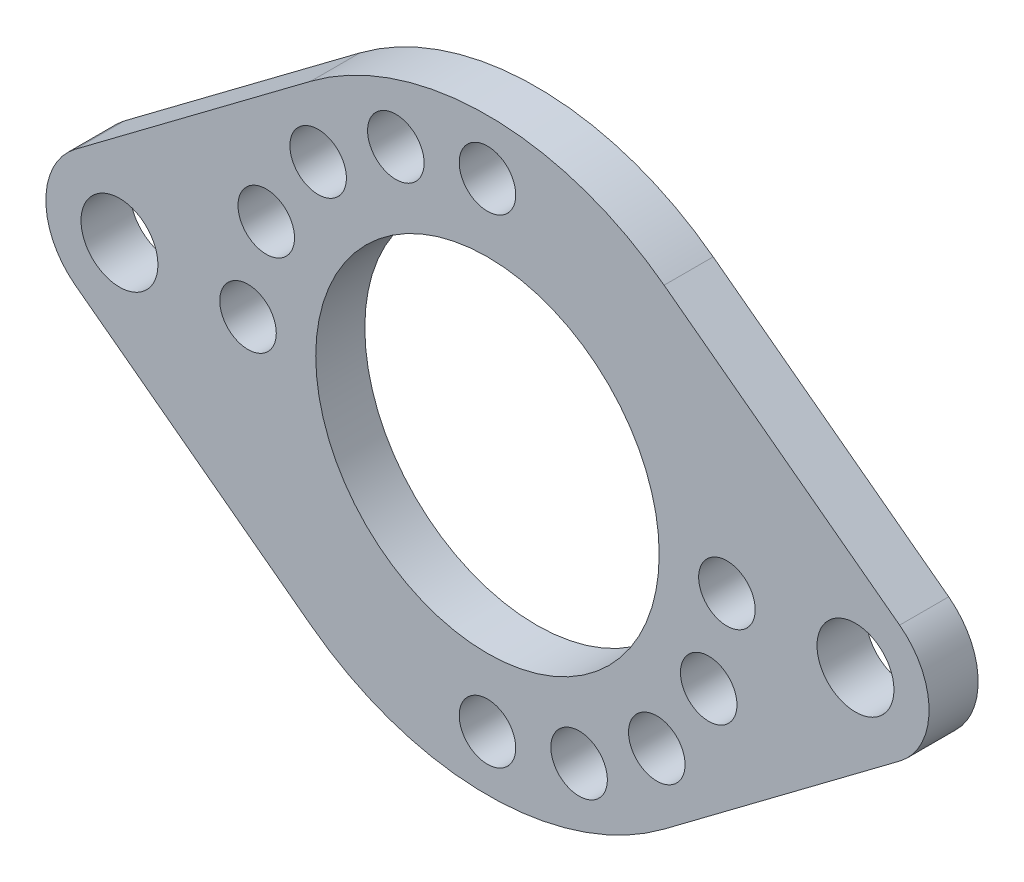
ISO-10303-21;
HEADER;
FILE_DESCRIPTION(('STEP AP214'),'2;1');
FILE_NAME('part.step','',(''),(''),'','','');
FILE_SCHEMA(('AUTOMOTIVE_DESIGN { 1 0 10303 214 1 1 1 1 }'));
ENDSEC;
DATA;
#1=APPLICATION_CONTEXT('core data for automotive mechanical design processes');
#2=APPLICATION_PROTOCOL_DEFINITION('international standard','automotive_design',2000,#1);
#3=PRODUCT_CONTEXT('',#1,'mechanical');
#4=PRODUCT('Part','Part','',(#3));
#5=PRODUCT_RELATED_PRODUCT_CATEGORY('part','',(#4));
#6=PRODUCT_DEFINITION_FORMATION('','',#4);
#7=PRODUCT_DEFINITION_CONTEXT('part definition',#1,'design');
#8=PRODUCT_DEFINITION('design','',#6,#7);
#9=PRODUCT_DEFINITION_SHAPE('','',#8);
#10=(LENGTH_UNIT() NAMED_UNIT(*) SI_UNIT(.MILLI.,.METRE.));
#11=(NAMED_UNIT(*) PLANE_ANGLE_UNIT() SI_UNIT($,.RADIAN.));
#12=(NAMED_UNIT(*) SI_UNIT($,.STERADIAN.) SOLID_ANGLE_UNIT());
#13=UNCERTAINTY_MEASURE_WITH_UNIT(LENGTH_MEASURE(1.E-05),#10,'distance_accuracy_value','');
#14=(GEOMETRIC_REPRESENTATION_CONTEXT(3) GLOBAL_UNCERTAINTY_ASSIGNED_CONTEXT((#13)) GLOBAL_UNIT_ASSIGNED_CONTEXT((#10,
#11,#12)) REPRESENTATION_CONTEXT('',''));
#15=CARTESIAN_POINT('',(0.,0.,0.));
#16=DIRECTION('',(0.,0.,1.));
#17=DIRECTION('',(1.,0.,0.));
#18=AXIS2_PLACEMENT_3D('',#15,#16,#17);
#19=CARTESIAN_POINT('',(0.,0.,-1.5875));
#20=DIRECTION('',(0.,0.,1.));
#21=DIRECTION('',(1.,0.,0.));
#22=AXIS2_PLACEMENT_3D('',#19,#20,#21);
#23=PLANE('',#22);
#24=CARTESIAN_POINT('',(0.,0.,-1.5875));
#25=DIRECTION('',(0.,0.,-1.));
#26=DIRECTION('',(-1.,0.,0.));
#27=AXIS2_PLACEMENT_3D('',#24,#25,#26);
#28=CIRCLE('',#27,11.1125);
#29=CARTESIAN_POINT('',(-11.1125,0.,-1.5875));
#30=VERTEX_POINT('',#29);
#31=EDGE_CURVE('E167',#30,#30,#28,.F.);
#32=ORIENTED_EDGE('',*,*,#31,.T.);
#33=EDGE_LOOP('',(#32));
#34=FACE_BOUND('',#33,.T.);
#35=CARTESIAN_POINT('',(-23.8125,0.,-1.5875));
#36=DIRECTION('',(0.,0.,-1.));
#37=DIRECTION('',(-1.,0.,0.));
#38=AXIS2_PLACEMENT_3D('',#35,#36,#37);
#39=CIRCLE('',#38,4.7625);
#40=CARTESIAN_POINT('',(-26.67,3.81,-1.5875));
#41=VERTEX_POINT('',#40);
#42=CARTESIAN_POINT('',(-26.67,-3.81,-1.5875));
#43=VERTEX_POINT('',#42);
#44=EDGE_CURVE('E171',#41,#43,#39,.F.);
#45=ORIENTED_EDGE('',*,*,#44,.F.);
#46=DIRECTION('',(-0.8,-0.6,0.));
#47=VECTOR('',#46,1.);
#48=CARTESIAN_POINT('',(-11.43,15.24,-1.5875));
#49=LINE('',#48,#47);
#50=CARTESIAN_POINT('',(-11.43,15.24,-1.5875));
#51=VERTEX_POINT('',#50);
#52=EDGE_CURVE('E110',#51,#41,#49,.T.);
#53=ORIENTED_EDGE('',*,*,#52,.F.);
#54=CARTESIAN_POINT('',(0.,0.,-1.5875));
#55=DIRECTION('',(0.,0.,-1.));
#56=DIRECTION('',(-1.,0.,0.));
#57=AXIS2_PLACEMENT_3D('',#54,#55,#56);
#58=CIRCLE('',#57,19.05);
#59=CARTESIAN_POINT('',(11.43,15.24,-1.5875));
#60=VERTEX_POINT('',#59);
#61=EDGE_CURVE('E115',#60,#51,#58,.F.);
#62=ORIENTED_EDGE('',*,*,#61,.F.);
#63=DIRECTION('',(0.8,-0.6,0.));
#64=VECTOR('',#63,1.);
#65=CARTESIAN_POINT('',(11.43,15.24,-1.5875));
#66=LINE('',#65,#64);
#67=CARTESIAN_POINT('',(26.67,3.81,-1.5875));
#68=VERTEX_POINT('',#67);
#69=EDGE_CURVE('E114',#60,#68,#66,.T.);
#70=ORIENTED_EDGE('',*,*,#69,.T.);
#71=CARTESIAN_POINT('',(23.8125,0.,-1.5875));
#72=DIRECTION('',(0.,0.,-1.));
#73=DIRECTION('',(-1.,0.,0.));
#74=AXIS2_PLACEMENT_3D('',#71,#72,#73);
#75=CIRCLE('',#74,4.7625);
#76=CARTESIAN_POINT('',(26.67,-3.81,-1.5875));
#77=VERTEX_POINT('',#76);
#78=EDGE_CURVE('E94',#77,#68,#75,.F.);
#79=ORIENTED_EDGE('',*,*,#78,.F.);
#80=DIRECTION('',(-0.8,-0.6,0.));
#81=VECTOR('',#80,1.);
#82=CARTESIAN_POINT('',(11.43,-15.24,-1.5875));
#83=LINE('',#82,#81);
#84=CARTESIAN_POINT('',(11.43,-15.24,-1.5875));
#85=VERTEX_POINT('',#84);
#86=EDGE_CURVE('E91',#77,#85,#83,.T.);
#87=ORIENTED_EDGE('',*,*,#86,.T.);
#88=CARTESIAN_POINT('',(0.,0.,-1.5875));
#89=DIRECTION('',(0.,0.,-1.));
#90=DIRECTION('',(-1.,0.,0.));
#91=AXIS2_PLACEMENT_3D('',#88,#89,#90);
#92=CIRCLE('',#91,19.05);
#93=CARTESIAN_POINT('',(-11.43,-15.24,-1.5875));
#94=VERTEX_POINT('',#93);
#95=EDGE_CURVE('E78',#94,#85,#92,.F.);
#96=ORIENTED_EDGE('',*,*,#95,.F.);
#97=DIRECTION('',(-0.8,0.6,0.));
#98=VECTOR('',#97,1.);
#99=CARTESIAN_POINT('',(-11.43,-15.24,-1.5875));
#100=LINE('',#99,#98);
#101=EDGE_CURVE('E88',#94,#43,#100,.T.);
#102=ORIENTED_EDGE('',*,*,#101,.T.);
#103=EDGE_LOOP('',(#45,#53,#62,#70,#79,#87,#96,#102));
#104=FACE_BOUND('',#103,.T.);
#105=CARTESIAN_POINT('',(0.,15.494,-1.5875));
#106=DIRECTION('',(0.,0.,1.));
#107=DIRECTION('',(1.,0.,0.));
#108=AXIS2_PLACEMENT_3D('',#105,#106,#107);
#109=CIRCLE('',#108,1.82879999999999);
#110=CARTESIAN_POINT('',(1.82879999999999,15.494,-1.5875));
#111=VERTEX_POINT('',#110);
#112=EDGE_CURVE('E109',#111,#111,#109,.T.);
#113=ORIENTED_EDGE('',*,*,#112,.T.);
#114=EDGE_LOOP('',(#113));
#115=FACE_BOUND('',#114,.T.);
#116=CARTESIAN_POINT('',(-15.494,0.,-1.5875));
#117=DIRECTION('',(0.,0.,1.));
#118=DIRECTION('',(1.,0.,0.));
#119=AXIS2_PLACEMENT_3D('',#116,#117,#118);
#120=CIRCLE('',#119,1.82879999999999);
#121=CARTESIAN_POINT('',(-13.6652,0.,-1.5875));
#122=VERTEX_POINT('',#121);
#123=EDGE_CURVE('E179',#122,#122,#120,.T.);
#124=ORIENTED_EDGE('',*,*,#123,.T.);
#125=EDGE_LOOP('',(#124));
#126=FACE_BOUND('',#125,.T.);
#127=CARTESIAN_POINT('',(-14.3145894767299,5.92929710106476,-1.5875));
#128=DIRECTION('',(0.,0.,1.));
#129=DIRECTION('',(1.,0.,0.));
#130=AXIS2_PLACEMENT_3D('',#127,#128,#129);
#131=CIRCLE('',#130,1.82879999999999);
#132=CARTESIAN_POINT('',(-12.4857894767299,5.92929710106476,-1.5875));
#133=VERTEX_POINT('',#132);
#134=EDGE_CURVE('E182',#133,#133,#131,.T.);
#135=ORIENTED_EDGE('',*,*,#134,.T.);
#136=EDGE_LOOP('',(#135));
#137=FACE_BOUND('',#136,.T.);
#138=CARTESIAN_POINT('',(-5.92929710106471,14.3145894767299,-1.5875));
#139=DIRECTION('',(0.,0.,1.));
#140=DIRECTION('',(1.,0.,0.));
#141=AXIS2_PLACEMENT_3D('',#138,#139,#140);
#142=CIRCLE('',#141,1.82879999999999);
#143=CARTESIAN_POINT('',(-4.10049710106472,14.3145894767299,-1.5875));
#144=VERTEX_POINT('',#143);
#145=EDGE_CURVE('E185',#144,#144,#142,.T.);
#146=ORIENTED_EDGE('',*,*,#145,.T.);
#147=EDGE_LOOP('',(#146));
#148=FACE_BOUND('',#147,.T.);
#149=CARTESIAN_POINT('',(-10.9559124677044,10.9559124677043,-1.5875));
#150=DIRECTION('',(0.,0.,1.));
#151=DIRECTION('',(1.,0.,0.));
#152=AXIS2_PLACEMENT_3D('',#149,#150,#151);
#153=CIRCLE('',#152,1.82879999999999);
#154=CARTESIAN_POINT('',(-9.1271124677044,10.9559124677043,-1.5875));
#155=VERTEX_POINT('',#154);
#156=EDGE_CURVE('E188',#155,#155,#153,.T.);
#157=ORIENTED_EDGE('',*,*,#156,.T.);
#158=EDGE_LOOP('',(#157));
#159=FACE_BOUND('',#158,.T.);
#160=CARTESIAN_POINT('',(0.,-15.494,-1.5875));
#161=DIRECTION('',(0.,0.,1.));
#162=DIRECTION('',(1.,0.,0.));
#163=AXIS2_PLACEMENT_3D('',#160,#161,#162);
#164=CIRCLE('',#163,1.82879999999999);
#165=CARTESIAN_POINT('',(1.82879999999999,-15.494,-1.5875));
#166=VERTEX_POINT('',#165);
#167=EDGE_CURVE('E191',#166,#166,#164,.T.);
#168=ORIENTED_EDGE('',*,*,#167,.T.);
#169=EDGE_LOOP('',(#168));
#170=FACE_BOUND('',#169,.T.);
#171=CARTESIAN_POINT('',(15.494,0.,-1.5875));
#172=DIRECTION('',(0.,0.,1.));
#173=DIRECTION('',(1.,0.,0.));
#174=AXIS2_PLACEMENT_3D('',#171,#172,#173);
#175=CIRCLE('',#174,1.82879999999999);
#176=CARTESIAN_POINT('',(17.3228,0.,-1.5875));
#177=VERTEX_POINT('',#176);
#178=EDGE_CURVE('E194',#177,#177,#175,.T.);
#179=ORIENTED_EDGE('',*,*,#178,.T.);
#180=EDGE_LOOP('',(#179));
#181=FACE_BOUND('',#180,.T.);
#182=CARTESIAN_POINT('',(14.3145894767299,-5.92929710106476,-1.5875));
#183=DIRECTION('',(0.,0.,1.));
#184=DIRECTION('',(1.,0.,0.));
#185=AXIS2_PLACEMENT_3D('',#182,#183,#184);
#186=CIRCLE('',#185,1.82879999999999);
#187=CARTESIAN_POINT('',(16.1433894767298,-5.92929710106476,-1.5875));
#188=VERTEX_POINT('',#187);
#189=EDGE_CURVE('E197',#188,#188,#186,.T.);
#190=ORIENTED_EDGE('',*,*,#189,.T.);
#191=EDGE_LOOP('',(#190));
#192=FACE_BOUND('',#191,.T.);
#193=CARTESIAN_POINT('',(5.92929710106471,-14.3145894767299,-1.5875));
#194=DIRECTION('',(0.,0.,1.));
#195=DIRECTION('',(1.,0.,0.));
#196=AXIS2_PLACEMENT_3D('',#193,#194,#195);
#197=CIRCLE('',#196,1.82879999999999);
#198=CARTESIAN_POINT('',(7.7580971010647,-14.3145894767299,-1.5875));
#199=VERTEX_POINT('',#198);
#200=EDGE_CURVE('E200',#199,#199,#197,.T.);
#201=ORIENTED_EDGE('',*,*,#200,.T.);
#202=EDGE_LOOP('',(#201));
#203=FACE_BOUND('',#202,.T.);
#204=CARTESIAN_POINT('',(10.9559124677044,-10.9559124677043,-1.5875));
#205=DIRECTION('',(0.,0.,1.));
#206=DIRECTION('',(1.,0.,0.));
#207=AXIS2_PLACEMENT_3D('',#204,#205,#206);
#208=CIRCLE('',#207,1.82879999999999);
#209=CARTESIAN_POINT('',(12.7847124677044,-10.9559124677043,-1.5875));
#210=VERTEX_POINT('',#209);
#211=EDGE_CURVE('E203',#210,#210,#208,.T.);
#212=ORIENTED_EDGE('',*,*,#211,.T.);
#213=EDGE_LOOP('',(#212));
#214=FACE_BOUND('',#213,.T.);
#215=CARTESIAN_POINT('',(-23.8125,0.,-1.5875));
#216=DIRECTION('',(0.,0.,1.));
#217=DIRECTION('',(1.,0.,0.));
#218=AXIS2_PLACEMENT_3D('',#215,#216,#217);
#219=CIRCLE('',#218,2.48919999999999);
#220=CARTESIAN_POINT('',(-21.3233,0.,-1.5875));
#221=VERTEX_POINT('',#220);
#222=EDGE_CURVE('E205',#221,#221,#219,.T.);
#223=ORIENTED_EDGE('',*,*,#222,.T.);
#224=EDGE_LOOP('',(#223));
#225=FACE_BOUND('',#224,.T.);
#226=CARTESIAN_POINT('',(23.8125,0.,-1.5875));
#227=DIRECTION('',(0.,0.,1.));
#228=DIRECTION('',(1.,0.,0.));
#229=AXIS2_PLACEMENT_3D('',#226,#227,#228);
#230=CIRCLE('',#229,2.48919999999999);
#231=CARTESIAN_POINT('',(26.3017,0.,-1.5875));
#232=VERTEX_POINT('',#231);
#233=EDGE_CURVE('E19',#232,#232,#230,.T.);
#234=ORIENTED_EDGE('',*,*,#233,.T.);
#235=EDGE_LOOP('',(#234));
#236=FACE_BOUND('',#235,.T.);
#237=ADVANCED_FACE('F16',(#34,#104,#115,#126,#137,#148,#159,#170,#181,#192,#203,#214,#225,#236),
#23,.F.);
#238=CARTESIAN_POINT('',(23.8125,0.,1.5875));
#239=DIRECTION('',(0.,0.,1.));
#240=DIRECTION('',(1.,0.,0.));
#241=AXIS2_PLACEMENT_3D('',#238,#239,#240);
#242=CYLINDRICAL_SURFACE('',#241,2.48919999999999);
#243=CARTESIAN_POINT('',(23.8125,0.,1.5875));
#244=DIRECTION('',(0.,0.,1.));
#245=DIRECTION('',(1.,0.,0.));
#246=AXIS2_PLACEMENT_3D('',#243,#244,#245);
#247=CIRCLE('',#246,2.48919999999999);
#248=CARTESIAN_POINT('',(26.3017,0.,1.5875));
#249=VERTEX_POINT('',#248);
#250=EDGE_CURVE('E164',#249,#249,#247,.F.);
#251=ORIENTED_EDGE('',*,*,#250,.F.);
#252=EDGE_LOOP('',(#251));
#253=FACE_BOUND('',#252,.T.);
#254=ORIENTED_EDGE('',*,*,#233,.F.);
#255=EDGE_LOOP('',(#254));
#256=FACE_BOUND('',#255,.T.);
#257=ADVANCED_FACE('F213',(#253,#256),#242,.F.);
#258=CARTESIAN_POINT('',(-23.8125,0.,1.5875));
#259=DIRECTION('',(0.,0.,1.));
#260=DIRECTION('',(1.,0.,0.));
#261=AXIS2_PLACEMENT_3D('',#258,#259,#260);
#262=CYLINDRICAL_SURFACE('',#261,2.48919999999999);
#263=CARTESIAN_POINT('',(-23.8125,0.,1.5875));
#264=DIRECTION('',(0.,0.,1.));
#265=DIRECTION('',(1.,0.,0.));
#266=AXIS2_PLACEMENT_3D('',#263,#264,#265);
#267=CIRCLE('',#266,2.48919999999999);
#268=CARTESIAN_POINT('',(-21.3233,0.,1.5875));
#269=VERTEX_POINT('',#268);
#270=EDGE_CURVE('E161',#269,#269,#267,.F.);
#271=ORIENTED_EDGE('',*,*,#270,.F.);
#272=EDGE_LOOP('',(#271));
#273=FACE_BOUND('',#272,.T.);
#274=ORIENTED_EDGE('',*,*,#222,.F.);
#275=EDGE_LOOP('',(#274));
#276=FACE_BOUND('',#275,.T.);
#277=ADVANCED_FACE('F215',(#273,#276),#262,.F.);
#278=CARTESIAN_POINT('',(10.9559124677044,-10.9559124677043,1.5875));
#279=DIRECTION('',(0.,0.,1.));
#280=DIRECTION('',(1.,0.,0.));
#281=AXIS2_PLACEMENT_3D('',#278,#279,#280);
#282=CYLINDRICAL_SURFACE('',#281,1.82879999999999);
#283=CARTESIAN_POINT('',(10.9559124677044,-10.9559124677043,1.5875));
#284=DIRECTION('',(0.,0.,1.));
#285=DIRECTION('',(1.,0.,0.));
#286=AXIS2_PLACEMENT_3D('',#283,#284,#285);
#287=CIRCLE('',#286,1.82879999999999);
#288=CARTESIAN_POINT('',(12.7847124677044,-10.9559124677043,1.5875));
#289=VERTEX_POINT('',#288);
#290=EDGE_CURVE('E158',#289,#289,#287,.F.);
#291=ORIENTED_EDGE('',*,*,#290,.F.);
#292=EDGE_LOOP('',(#291));
#293=FACE_BOUND('',#292,.T.);
#294=ORIENTED_EDGE('',*,*,#211,.F.);
#295=EDGE_LOOP('',(#294));
#296=FACE_BOUND('',#295,.T.);
#297=ADVANCED_FACE('F222',(#293,#296),#282,.F.);
#298=CARTESIAN_POINT('',(5.92929710106471,-14.3145894767299,1.5875));
#299=DIRECTION('',(0.,0.,1.));
#300=DIRECTION('',(1.,0.,0.));
#301=AXIS2_PLACEMENT_3D('',#298,#299,#300);
#302=CYLINDRICAL_SURFACE('',#301,1.82879999999999);
#303=CARTESIAN_POINT('',(5.92929710106471,-14.3145894767299,1.5875));
#304=DIRECTION('',(0.,0.,1.));
#305=DIRECTION('',(1.,0.,0.));
#306=AXIS2_PLACEMENT_3D('',#303,#304,#305);
#307=CIRCLE('',#306,1.82879999999999);
#308=CARTESIAN_POINT('',(7.7580971010647,-14.3145894767299,1.5875));
#309=VERTEX_POINT('',#308);
#310=EDGE_CURVE('E155',#309,#309,#307,.F.);
#311=ORIENTED_EDGE('',*,*,#310,.F.);
#312=EDGE_LOOP('',(#311));
#313=FACE_BOUND('',#312,.T.);
#314=ORIENTED_EDGE('',*,*,#200,.F.);
#315=EDGE_LOOP('',(#314));
#316=FACE_BOUND('',#315,.T.);
#317=ADVANCED_FACE('F297',(#313,#316),#302,.F.);
#318=CARTESIAN_POINT('',(14.3145894767299,-5.92929710106476,1.5875));
#319=DIRECTION('',(0.,0.,1.));
#320=DIRECTION('',(1.,0.,0.));
#321=AXIS2_PLACEMENT_3D('',#318,#319,#320);
#322=CYLINDRICAL_SURFACE('',#321,1.82879999999999);
#323=CARTESIAN_POINT('',(14.3145894767299,-5.92929710106476,1.5875));
#324=DIRECTION('',(0.,0.,1.));
#325=DIRECTION('',(1.,0.,0.));
#326=AXIS2_PLACEMENT_3D('',#323,#324,#325);
#327=CIRCLE('',#326,1.82879999999999);
#328=CARTESIAN_POINT('',(16.1433894767298,-5.92929710106476,1.5875));
#329=VERTEX_POINT('',#328);
#330=EDGE_CURVE('E152',#329,#329,#327,.F.);
#331=ORIENTED_EDGE('',*,*,#330,.F.);
#332=EDGE_LOOP('',(#331));
#333=FACE_BOUND('',#332,.T.);
#334=ORIENTED_EDGE('',*,*,#189,.F.);
#335=EDGE_LOOP('',(#334));
#336=FACE_BOUND('',#335,.T.);
#337=ADVANCED_FACE('F293',(#333,#336),#322,.F.);
#338=CARTESIAN_POINT('',(15.494,0.,1.5875));
#339=DIRECTION('',(0.,0.,1.));
#340=DIRECTION('',(1.,0.,0.));
#341=AXIS2_PLACEMENT_3D('',#338,#339,#340);
#342=CYLINDRICAL_SURFACE('',#341,1.82879999999999);
#343=CARTESIAN_POINT('',(15.494,0.,1.5875));
#344=DIRECTION('',(0.,0.,1.));
#345=DIRECTION('',(1.,0.,0.));
#346=AXIS2_PLACEMENT_3D('',#343,#344,#345);
#347=CIRCLE('',#346,1.82879999999999);
#348=CARTESIAN_POINT('',(17.3228,0.,1.5875));
#349=VERTEX_POINT('',#348);
#350=EDGE_CURVE('E149',#349,#349,#347,.F.);
#351=ORIENTED_EDGE('',*,*,#350,.F.);
#352=EDGE_LOOP('',(#351));
#353=FACE_BOUND('',#352,.T.);
#354=ORIENTED_EDGE('',*,*,#178,.F.);
#355=EDGE_LOOP('',(#354));
#356=FACE_BOUND('',#355,.T.);
#357=ADVANCED_FACE('F289',(#353,#356),#342,.F.);
#358=CARTESIAN_POINT('',(0.,-15.494,1.5875));
#359=DIRECTION('',(0.,0.,1.));
#360=DIRECTION('',(1.,0.,0.));
#361=AXIS2_PLACEMENT_3D('',#358,#359,#360);
#362=CYLINDRICAL_SURFACE('',#361,1.82879999999999);
#363=CARTESIAN_POINT('',(0.,-15.494,1.5875));
#364=DIRECTION('',(0.,0.,1.));
#365=DIRECTION('',(1.,0.,0.));
#366=AXIS2_PLACEMENT_3D('',#363,#364,#365);
#367=CIRCLE('',#366,1.82879999999999);
#368=CARTESIAN_POINT('',(1.82879999999999,-15.494,1.5875));
#369=VERTEX_POINT('',#368);
#370=EDGE_CURVE('E146',#369,#369,#367,.F.);
#371=ORIENTED_EDGE('',*,*,#370,.F.);
#372=EDGE_LOOP('',(#371));
#373=FACE_BOUND('',#372,.T.);
#374=ORIENTED_EDGE('',*,*,#167,.F.);
#375=EDGE_LOOP('',(#374));
#376=FACE_BOUND('',#375,.T.);
#377=ADVANCED_FACE('F285',(#373,#376),#362,.F.);
#378=CARTESIAN_POINT('',(-10.9559124677044,10.9559124677043,1.5875));
#379=DIRECTION('',(0.,0.,1.));
#380=DIRECTION('',(1.,0.,0.));
#381=AXIS2_PLACEMENT_3D('',#378,#379,#380);
#382=CYLINDRICAL_SURFACE('',#381,1.82879999999999);
#383=CARTESIAN_POINT('',(-10.9559124677044,10.9559124677043,1.5875));
#384=DIRECTION('',(0.,0.,1.));
#385=DIRECTION('',(1.,0.,0.));
#386=AXIS2_PLACEMENT_3D('',#383,#384,#385);
#387=CIRCLE('',#386,1.82879999999999);
#388=CARTESIAN_POINT('',(-9.1271124677044,10.9559124677043,1.5875));
#389=VERTEX_POINT('',#388);
#390=EDGE_CURVE('E143',#389,#389,#387,.F.);
#391=ORIENTED_EDGE('',*,*,#390,.F.);
#392=EDGE_LOOP('',(#391));
#393=FACE_BOUND('',#392,.T.);
#394=ORIENTED_EDGE('',*,*,#156,.F.);
#395=EDGE_LOOP('',(#394));
#396=FACE_BOUND('',#395,.T.);
#397=ADVANCED_FACE('F281',(#393,#396),#382,.F.);
#398=CARTESIAN_POINT('',(-5.92929710106471,14.3145894767299,1.5875));
#399=DIRECTION('',(0.,0.,1.));
#400=DIRECTION('',(1.,0.,0.));
#401=AXIS2_PLACEMENT_3D('',#398,#399,#400);
#402=CYLINDRICAL_SURFACE('',#401,1.82879999999999);
#403=CARTESIAN_POINT('',(-5.92929710106471,14.3145894767299,1.5875));
#404=DIRECTION('',(0.,0.,1.));
#405=DIRECTION('',(1.,0.,0.));
#406=AXIS2_PLACEMENT_3D('',#403,#404,#405);
#407=CIRCLE('',#406,1.82879999999999);
#408=CARTESIAN_POINT('',(-4.10049710106472,14.3145894767299,1.5875));
#409=VERTEX_POINT('',#408);
#410=EDGE_CURVE('E140',#409,#409,#407,.F.);
#411=ORIENTED_EDGE('',*,*,#410,.F.);
#412=EDGE_LOOP('',(#411));
#413=FACE_BOUND('',#412,.T.);
#414=ORIENTED_EDGE('',*,*,#145,.F.);
#415=EDGE_LOOP('',(#414));
#416=FACE_BOUND('',#415,.T.);
#417=ADVANCED_FACE('F277',(#413,#416),#402,.F.);
#418=CARTESIAN_POINT('',(-14.3145894767299,5.92929710106476,1.5875));
#419=DIRECTION('',(0.,0.,1.));
#420=DIRECTION('',(1.,0.,0.));
#421=AXIS2_PLACEMENT_3D('',#418,#419,#420);
#422=CYLINDRICAL_SURFACE('',#421,1.82879999999999);
#423=CARTESIAN_POINT('',(-14.3145894767299,5.92929710106476,1.5875));
#424=DIRECTION('',(0.,0.,1.));
#425=DIRECTION('',(1.,0.,0.));
#426=AXIS2_PLACEMENT_3D('',#423,#424,#425);
#427=CIRCLE('',#426,1.82879999999999);
#428=CARTESIAN_POINT('',(-12.4857894767299,5.92929710106476,1.5875));
#429=VERTEX_POINT('',#428);
#430=EDGE_CURVE('E137',#429,#429,#427,.F.);
#431=ORIENTED_EDGE('',*,*,#430,.F.);
#432=EDGE_LOOP('',(#431));
#433=FACE_BOUND('',#432,.T.);
#434=ORIENTED_EDGE('',*,*,#134,.F.);
#435=EDGE_LOOP('',(#434));
#436=FACE_BOUND('',#435,.T.);
#437=ADVANCED_FACE('F273',(#433,#436),#422,.F.);
#438=CARTESIAN_POINT('',(-15.494,0.,1.5875));
#439=DIRECTION('',(0.,0.,1.));
#440=DIRECTION('',(1.,0.,0.));
#441=AXIS2_PLACEMENT_3D('',#438,#439,#440);
#442=CYLINDRICAL_SURFACE('',#441,1.82879999999999);
#443=CARTESIAN_POINT('',(-15.494,0.,1.5875));
#444=DIRECTION('',(0.,0.,1.));
#445=DIRECTION('',(1.,0.,0.));
#446=AXIS2_PLACEMENT_3D('',#443,#444,#445);
#447=CIRCLE('',#446,1.82879999999999);
#448=CARTESIAN_POINT('',(-13.6652,0.,1.5875));
#449=VERTEX_POINT('',#448);
#450=EDGE_CURVE('E134',#449,#449,#447,.F.);
#451=ORIENTED_EDGE('',*,*,#450,.F.);
#452=EDGE_LOOP('',(#451));
#453=FACE_BOUND('',#452,.T.);
#454=ORIENTED_EDGE('',*,*,#123,.F.);
#455=EDGE_LOOP('',(#454));
#456=FACE_BOUND('',#455,.T.);
#457=ADVANCED_FACE('F269',(#453,#456),#442,.F.);
#458=CARTESIAN_POINT('',(0.,15.494,1.5875));
#459=DIRECTION('',(0.,0.,1.));
#460=DIRECTION('',(1.,0.,0.));
#461=AXIS2_PLACEMENT_3D('',#458,#459,#460);
#462=CYLINDRICAL_SURFACE('',#461,1.82879999999999);
#463=CARTESIAN_POINT('',(0.,15.494,1.5875));
#464=DIRECTION('',(0.,0.,1.));
#465=DIRECTION('',(1.,0.,0.));
#466=AXIS2_PLACEMENT_3D('',#463,#464,#465);
#467=CIRCLE('',#466,1.82879999999999);
#468=CARTESIAN_POINT('',(1.82879999999999,15.494,1.5875));
#469=VERTEX_POINT('',#468);
#470=EDGE_CURVE('E131',#469,#469,#467,.F.);
#471=ORIENTED_EDGE('',*,*,#470,.F.);
#472=EDGE_LOOP('',(#471));
#473=FACE_BOUND('',#472,.T.);
#474=ORIENTED_EDGE('',*,*,#112,.F.);
#475=EDGE_LOOP('',(#474));
#476=FACE_BOUND('',#475,.T.);
#477=ADVANCED_FACE('F265',(#473,#476),#462,.F.);
#478=CARTESIAN_POINT('',(-11.43,-15.24,1.5875));
#479=DIRECTION('',(0.6,0.8,0.));
#480=DIRECTION('',(-0.8,0.6,0.));
#481=AXIS2_PLACEMENT_3D('',#478,#479,#480);
#482=PLANE('',#481);
#483=DIRECTION('',(0.,0.,-1.));
#484=VECTOR('',#483,1.);
#485=CARTESIAN_POINT('',(-11.43,-15.24,1.5875));
#486=LINE('',#485,#484);
#487=CARTESIAN_POINT('',(-11.43,-15.24,1.5875));
#488=VERTEX_POINT('',#487);
#489=EDGE_CURVE('E87',#488,#94,#486,.T.);
#490=ORIENTED_EDGE('',*,*,#489,.F.);
#491=DIRECTION('',(0.8,-0.6,0.));
#492=VECTOR('',#491,1.);
#493=CARTESIAN_POINT('',(-26.67,-3.81,1.5875));
#494=LINE('',#493,#492);
#495=CARTESIAN_POINT('',(-26.67,-3.81,1.5875));
#496=VERTEX_POINT('',#495);
#497=EDGE_CURVE('E130',#496,#488,#494,.T.);
#498=ORIENTED_EDGE('',*,*,#497,.F.);
#499=DIRECTION('',(0.,0.,-1.));
#500=VECTOR('',#499,1.);
#501=CARTESIAN_POINT('',(-26.67,-3.81,1.5875));
#502=LINE('',#501,#500);
#503=EDGE_CURVE('E170',#43,#496,#502,.F.);
#504=ORIENTED_EDGE('',*,*,#503,.F.);
#505=ORIENTED_EDGE('',*,*,#101,.F.);
#506=EDGE_LOOP('',(#490,#498,#504,#505));
#507=FACE_BOUND('',#506,.T.);
#508=ADVANCED_FACE('F262',(#507),#482,.F.);
#509=CARTESIAN_POINT('',(0.,0.,1.5875));
#510=DIRECTION('',(0.,0.,-1.));
#511=DIRECTION('',(-1.,0.,0.));
#512=AXIS2_PLACEMENT_3D('',#509,#510,#511);
#513=CYLINDRICAL_SURFACE('',#512,19.05);
#514=CARTESIAN_POINT('',(0.,0.,1.5875));
#515=DIRECTION('',(0.,0.,-1.));
#516=DIRECTION('',(-1.,0.,0.));
#517=AXIS2_PLACEMENT_3D('',#514,#515,#516);
#518=CIRCLE('',#517,19.05);
#519=CARTESIAN_POINT('',(11.43,-15.24,1.5875));
#520=VERTEX_POINT('',#519);
#521=EDGE_CURVE('E128',#488,#520,#518,.F.);
#522=ORIENTED_EDGE('',*,*,#521,.F.);
#523=ORIENTED_EDGE('',*,*,#489,.T.);
#524=ORIENTED_EDGE('',*,*,#95,.T.);
#525=DIRECTION('',(0.,0.,1.));
#526=VECTOR('',#525,1.);
#527=CARTESIAN_POINT('',(11.43,-15.24,1.5875));
#528=LINE('',#527,#526);
#529=EDGE_CURVE('E85',#85,#520,#528,.T.);
#530=ORIENTED_EDGE('',*,*,#529,.T.);
#531=EDGE_LOOP('',(#522,#523,#524,#530));
#532=FACE_BOUND('',#531,.T.);
#533=ADVANCED_FACE('F83',(#532),#513,.T.);
#534=CARTESIAN_POINT('',(11.43,-15.24,1.5875));
#535=DIRECTION('',(-0.6,0.8,0.));
#536=DIRECTION('',(-0.8,-0.6,0.));
#537=AXIS2_PLACEMENT_3D('',#534,#535,#536);
#538=PLANE('',#537);
#539=DIRECTION('',(0.,0.,-1.));
#540=VECTOR('',#539,1.);
#541=CARTESIAN_POINT('',(26.67,-3.81,1.5875));
#542=LINE('',#541,#540);
#543=CARTESIAN_POINT('',(26.67,-3.81,1.5875));
#544=VERTEX_POINT('',#543);
#545=EDGE_CURVE('E105',#544,#77,#542,.T.);
#546=ORIENTED_EDGE('',*,*,#545,.F.);
#547=DIRECTION('',(0.8,0.6,0.));
#548=VECTOR('',#547,1.);
#549=CARTESIAN_POINT('',(11.43,-15.24,1.5875));
#550=LINE('',#549,#548);
#551=EDGE_CURVE('E100',#520,#544,#550,.T.);
#552=ORIENTED_EDGE('',*,*,#551,.F.);
#553=ORIENTED_EDGE('',*,*,#529,.F.);
#554=ORIENTED_EDGE('',*,*,#86,.F.);
#555=EDGE_LOOP('',(#546,#552,#553,#554));
#556=FACE_BOUND('',#555,.T.);
#557=ADVANCED_FACE('F98',(#556),#538,.F.);
#558=CARTESIAN_POINT('',(23.8125,0.,1.5875));
#559=DIRECTION('',(0.,0.,-1.));
#560=DIRECTION('',(-1.,0.,0.));
#561=AXIS2_PLACEMENT_3D('',#558,#559,#560);
#562=CYLINDRICAL_SURFACE('',#561,4.7625);
#563=CARTESIAN_POINT('',(23.8125,0.,1.5875));
#564=DIRECTION('',(0.,0.,-1.));
#565=DIRECTION('',(-1.,0.,0.));
#566=AXIS2_PLACEMENT_3D('',#563,#564,#565);
#567=CIRCLE('',#566,4.7625);
#568=CARTESIAN_POINT('',(26.67,3.81,1.5875));
#569=VERTEX_POINT('',#568);
#570=EDGE_CURVE('E125',#544,#569,#567,.F.);
#571=ORIENTED_EDGE('',*,*,#570,.F.);
#572=ORIENTED_EDGE('',*,*,#545,.T.);
#573=ORIENTED_EDGE('',*,*,#78,.T.);
#574=DIRECTION('',(0.,0.,1.));
#575=VECTOR('',#574,1.);
#576=CARTESIAN_POINT('',(26.67,3.81,1.5875));
#577=LINE('',#576,#575);
#578=EDGE_CURVE('E116',#68,#569,#577,.T.);
#579=ORIENTED_EDGE('',*,*,#578,.T.);
#580=EDGE_LOOP('',(#571,#572,#573,#579));
#581=FACE_BOUND('',#580,.T.);
#582=ADVANCED_FACE('F253',(#581),#562,.T.);
#583=CARTESIAN_POINT('',(11.43,15.24,1.5875));
#584=DIRECTION('',(-0.6,-0.8,0.));
#585=DIRECTION('',(0.8,-0.6,0.));
#586=AXIS2_PLACEMENT_3D('',#583,#584,#585);
#587=PLANE('',#586);
#588=DIRECTION('',(0.,0.,-1.));
#589=VECTOR('',#588,1.);
#590=CARTESIAN_POINT('',(11.43,15.24,1.5875));
#591=LINE('',#590,#589);
#592=CARTESIAN_POINT('',(11.43,15.24,1.5875));
#593=VERTEX_POINT('',#592);
#594=EDGE_CURVE('E113',#593,#60,#591,.T.);
#595=ORIENTED_EDGE('',*,*,#594,.F.);
#596=DIRECTION('',(-0.8,0.6,0.));
#597=VECTOR('',#596,1.);
#598=CARTESIAN_POINT('',(26.67,3.81,1.5875));
#599=LINE('',#598,#597);
#600=EDGE_CURVE('E124',#569,#593,#599,.T.);
#601=ORIENTED_EDGE('',*,*,#600,.F.);
#602=ORIENTED_EDGE('',*,*,#578,.F.);
#603=ORIENTED_EDGE('',*,*,#69,.F.);
#604=EDGE_LOOP('',(#595,#601,#602,#603));
#605=FACE_BOUND('',#604,.T.);
#606=ADVANCED_FACE('F249',(#605),#587,.F.);
#607=CARTESIAN_POINT('',(0.,0.,1.5875));
#608=DIRECTION('',(0.,0.,-1.));
#609=DIRECTION('',(-1.,0.,0.));
#610=AXIS2_PLACEMENT_3D('',#607,#608,#609);
#611=CYLINDRICAL_SURFACE('',#610,19.05);
#612=CARTESIAN_POINT('',(0.,0.,1.5875));
#613=DIRECTION('',(0.,0.,-1.));
#614=DIRECTION('',(-1.,0.,0.));
#615=AXIS2_PLACEMENT_3D('',#612,#613,#614);
#616=CIRCLE('',#615,19.05);
#617=CARTESIAN_POINT('',(-11.43,15.24,1.5875));
#618=VERTEX_POINT('',#617);
#619=EDGE_CURVE('E121',#593,#618,#616,.F.);
#620=ORIENTED_EDGE('',*,*,#619,.F.);
#621=ORIENTED_EDGE('',*,*,#594,.T.);
#622=ORIENTED_EDGE('',*,*,#61,.T.);
#623=DIRECTION('',(0.,0.,1.));
#624=VECTOR('',#623,1.);
#625=CARTESIAN_POINT('',(-11.43,15.24,1.5875));
#626=LINE('',#625,#624);
#627=EDGE_CURVE('E112',#618,#51,#626,.F.);
#628=ORIENTED_EDGE('',*,*,#627,.F.);
#629=EDGE_LOOP('',(#620,#621,#622,#628));
#630=FACE_BOUND('',#629,.T.);
#631=ADVANCED_FACE('F246',(#630),#611,.T.);
#632=CARTESIAN_POINT('',(-11.43,15.24,1.5875));
#633=DIRECTION('',(-0.6,0.8,0.));
#634=DIRECTION('',(-0.8,-0.6,0.));
#635=AXIS2_PLACEMENT_3D('',#632,#633,#634);
#636=PLANE('',#635);
#637=DIRECTION('',(-0.8,-0.6,0.));
#638=VECTOR('',#637,1.);
#639=CARTESIAN_POINT('',(-11.43,15.24,1.5875));
#640=LINE('',#639,#638);
#641=CARTESIAN_POINT('',(-26.67,3.81,1.5875));
#642=VERTEX_POINT('',#641);
#643=EDGE_CURVE('E120',#618,#642,#640,.T.);
#644=ORIENTED_EDGE('',*,*,#643,.F.);
#645=ORIENTED_EDGE('',*,*,#627,.T.);
#646=ORIENTED_EDGE('',*,*,#52,.T.);
#647=DIRECTION('',(0.,0.,-1.));
#648=VECTOR('',#647,1.);
#649=CARTESIAN_POINT('',(-26.67,3.81,1.5875));
#650=LINE('',#649,#648);
#651=EDGE_CURVE('E34',#642,#41,#650,.T.);
#652=ORIENTED_EDGE('',*,*,#651,.F.);
#653=EDGE_LOOP('',(#644,#645,#646,#652));
#654=FACE_BOUND('',#653,.T.);
#655=ADVANCED_FACE('F242',(#654),#636,.T.);
#656=CARTESIAN_POINT('',(-23.8125,0.,1.5875));
#657=DIRECTION('',(0.,0.,-1.));
#658=DIRECTION('',(-1.,0.,0.));
#659=AXIS2_PLACEMENT_3D('',#656,#657,#658);
#660=CYLINDRICAL_SURFACE('',#659,4.7625);
#661=ORIENTED_EDGE('',*,*,#44,.T.);
#662=ORIENTED_EDGE('',*,*,#503,.T.);
#663=CARTESIAN_POINT('',(-23.8125,0.,1.5875));
#664=DIRECTION('',(0.,0.,-1.));
#665=DIRECTION('',(-1.,0.,0.));
#666=AXIS2_PLACEMENT_3D('',#663,#664,#665);
#667=CIRCLE('',#666,4.7625);
#668=EDGE_CURVE('E25',#642,#496,#667,.F.);
#669=ORIENTED_EDGE('',*,*,#668,.F.);
#670=ORIENTED_EDGE('',*,*,#651,.T.);
#671=EDGE_LOOP('',(#661,#662,#669,#670));
#672=FACE_BOUND('',#671,.T.);
#673=ADVANCED_FACE('F235',(#672),#660,.T.);
#674=CARTESIAN_POINT('',(0.,0.,1.5875));
#675=DIRECTION('',(0.,0.,-1.));
#676=DIRECTION('',(-1.,0.,0.));
#677=AXIS2_PLACEMENT_3D('',#674,#675,#676);
#678=CYLINDRICAL_SURFACE('',#677,11.1125);
#679=CARTESIAN_POINT('',(0.,0.,1.5875));
#680=DIRECTION('',(0.,0.,-1.));
#681=DIRECTION('',(-1.,0.,0.));
#682=AXIS2_PLACEMENT_3D('',#679,#680,#681);
#683=CIRCLE('',#682,11.1125);
#684=CARTESIAN_POINT('',(-11.1125,0.,1.5875));
#685=VERTEX_POINT('',#684);
#686=EDGE_CURVE('E11',#685,#685,#683,.T.);
#687=ORIENTED_EDGE('',*,*,#686,.F.);
#688=EDGE_LOOP('',(#687));
#689=FACE_BOUND('',#688,.T.);
#690=ORIENTED_EDGE('',*,*,#31,.F.);
#691=EDGE_LOOP('',(#690));
#692=FACE_BOUND('',#691,.T.);
#693=ADVANCED_FACE('F229',(#689,#692),#678,.F.);
#694=CARTESIAN_POINT('',(0.,0.,1.5875));
#695=DIRECTION('',(0.,0.,1.));
#696=DIRECTION('',(1.,0.,0.));
#697=AXIS2_PLACEMENT_3D('',#694,#695,#696);
#698=PLANE('',#697);
#699=ORIENTED_EDGE('',*,*,#686,.T.);
#700=EDGE_LOOP('',(#699));
#701=FACE_BOUND('',#700,.T.);
#702=ORIENTED_EDGE('',*,*,#668,.T.);
#703=ORIENTED_EDGE('',*,*,#497,.T.);
#704=ORIENTED_EDGE('',*,*,#521,.T.);
#705=ORIENTED_EDGE('',*,*,#551,.T.);
#706=ORIENTED_EDGE('',*,*,#570,.T.);
#707=ORIENTED_EDGE('',*,*,#600,.T.);
#708=ORIENTED_EDGE('',*,*,#619,.T.);
#709=ORIENTED_EDGE('',*,*,#643,.T.);
#710=EDGE_LOOP('',(#702,#703,#704,#705,#706,#707,#708,#709));
#711=FACE_BOUND('',#710,.T.);
#712=ORIENTED_EDGE('',*,*,#470,.T.);
#713=EDGE_LOOP('',(#712));
#714=FACE_BOUND('',#713,.T.);
#715=ORIENTED_EDGE('',*,*,#450,.T.);
#716=EDGE_LOOP('',(#715));
#717=FACE_BOUND('',#716,.T.);
#718=ORIENTED_EDGE('',*,*,#430,.T.);
#719=EDGE_LOOP('',(#718));
#720=FACE_BOUND('',#719,.T.);
#721=ORIENTED_EDGE('',*,*,#410,.T.);
#722=EDGE_LOOP('',(#721));
#723=FACE_BOUND('',#722,.T.);
#724=ORIENTED_EDGE('',*,*,#390,.T.);
#725=EDGE_LOOP('',(#724));
#726=FACE_BOUND('',#725,.T.);
#727=ORIENTED_EDGE('',*,*,#370,.T.);
#728=EDGE_LOOP('',(#727));
#729=FACE_BOUND('',#728,.T.);
#730=ORIENTED_EDGE('',*,*,#350,.T.);
#731=EDGE_LOOP('',(#730));
#732=FACE_BOUND('',#731,.T.);
#733=ORIENTED_EDGE('',*,*,#330,.T.);
#734=EDGE_LOOP('',(#733));
#735=FACE_BOUND('',#734,.T.);
#736=ORIENTED_EDGE('',*,*,#310,.T.);
#737=EDGE_LOOP('',(#736));
#738=FACE_BOUND('',#737,.T.);
#739=ORIENTED_EDGE('',*,*,#290,.T.);
#740=EDGE_LOOP('',(#739));
#741=FACE_BOUND('',#740,.T.);
#742=ORIENTED_EDGE('',*,*,#270,.T.);
#743=EDGE_LOOP('',(#742));
#744=FACE_BOUND('',#743,.T.);
#745=ORIENTED_EDGE('',*,*,#250,.T.);
#746=EDGE_LOOP('',(#745));
#747=FACE_BOUND('',#746,.T.);
#748=ADVANCED_FACE('F227',(#701,#711,#714,#717,#720,#723,#726,#729,#732,#735,#738,#741,#744,
#747),#698,.T.);
#749=CLOSED_SHELL('',(#237,#257,#277,#297,#317,#337,#357,#377,#397,#417,#437,#457,#477,#508,
#533,#557,#582,#606,#631,#655,#673,#693,#748));
#750=MANIFOLD_SOLID_BREP('B1',#749);
#751=ADVANCED_BREP_SHAPE_REPRESENTATION('',(#18,#750),#14);
#752=SHAPE_DEFINITION_REPRESENTATION(#9,#751);
ENDSEC;
END-ISO-10303-21;
